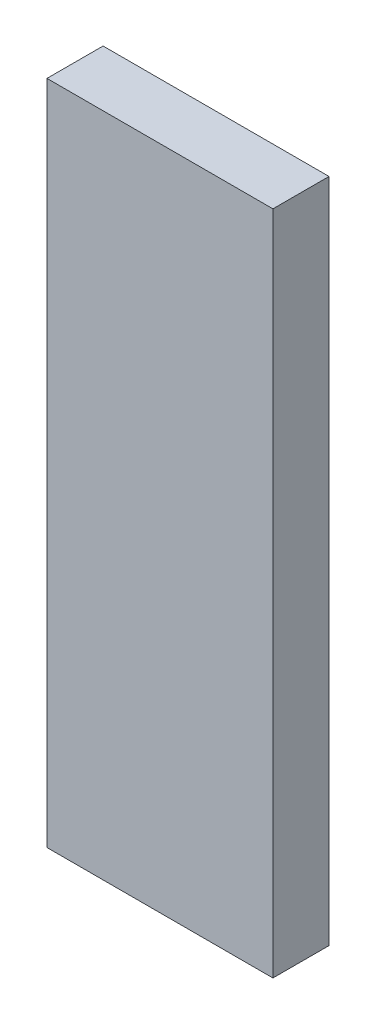
ISO-10303-21;
HEADER;
FILE_DESCRIPTION(('STEP AP214'),'2;1');
FILE_NAME('part.step','',(''),(''),'','','');
FILE_SCHEMA(('AUTOMOTIVE_DESIGN { 1 0 10303 214 1 1 1 1 }'));
ENDSEC;
DATA;
#1=APPLICATION_CONTEXT('core data for automotive mechanical design processes');
#2=APPLICATION_PROTOCOL_DEFINITION('international standard','automotive_design',2000,#1);
#3=PRODUCT_CONTEXT('',#1,'mechanical');
#4=PRODUCT('Part','Part','',(#3));
#5=PRODUCT_RELATED_PRODUCT_CATEGORY('part','',(#4));
#6=PRODUCT_DEFINITION_FORMATION('','',#4);
#7=PRODUCT_DEFINITION_CONTEXT('part definition',#1,'design');
#8=PRODUCT_DEFINITION('design','',#6,#7);
#9=PRODUCT_DEFINITION_SHAPE('','',#8);
#10=(LENGTH_UNIT() NAMED_UNIT(*) SI_UNIT(.MILLI.,.METRE.));
#11=(NAMED_UNIT(*) PLANE_ANGLE_UNIT() SI_UNIT($,.RADIAN.));
#12=(NAMED_UNIT(*) SI_UNIT($,.STERADIAN.) SOLID_ANGLE_UNIT());
#13=UNCERTAINTY_MEASURE_WITH_UNIT(LENGTH_MEASURE(1.E-05),#10,'distance_accuracy_value','');
#14=(GEOMETRIC_REPRESENTATION_CONTEXT(3) GLOBAL_UNCERTAINTY_ASSIGNED_CONTEXT((#13)) GLOBAL_UNIT_ASSIGNED_CONTEXT((#10,
#11,#12)) REPRESENTATION_CONTEXT('',''));
#15=CARTESIAN_POINT('',(0.,0.,0.));
#16=DIRECTION('',(0.,0.,1.));
#17=DIRECTION('',(1.,0.,0.));
#18=AXIS2_PLACEMENT_3D('',#15,#16,#17);
#19=CARTESIAN_POINT('',(-14.5,85.5,-3.6));
#20=DIRECTION('',(1.,0.,0.));
#21=DIRECTION('',(0.,0.,-1.));
#22=AXIS2_PLACEMENT_3D('',#19,#20,#21);
#23=PLANE('',#22);
#24=DIRECTION('',(0.,0.,1.));
#25=VECTOR('',#24,1.);
#26=CARTESIAN_POINT('',(-14.5,0.,-3.6));
#27=LINE('',#26,#25);
#28=CARTESIAN_POINT('',(-14.5,0.,-3.6));
#29=VERTEX_POINT('',#28);
#30=CARTESIAN_POINT('',(-14.5,0.,3.6));
#31=VERTEX_POINT('',#30);
#32=EDGE_CURVE('E111',#29,#31,#27,.T.);
#33=ORIENTED_EDGE('',*,*,#32,.T.);
#34=DIRECTION('',(0.,-1.,0.));
#35=VECTOR('',#34,1.);
#36=CARTESIAN_POINT('',(-14.5,85.5,3.6));
#37=LINE('',#36,#35);
#38=CARTESIAN_POINT('',(-14.5,85.5,3.6));
#39=VERTEX_POINT('',#38);
#40=EDGE_CURVE('E11',#39,#31,#37,.T.);
#41=ORIENTED_EDGE('',*,*,#40,.F.);
#42=DIRECTION('',(0.,0.,1.));
#43=VECTOR('',#42,1.);
#44=CARTESIAN_POINT('',(-14.5,85.5,-3.6));
#45=LINE('',#44,#43);
#46=CARTESIAN_POINT('',(-14.5,85.5,-3.6));
#47=VERTEX_POINT('',#46);
#48=EDGE_CURVE('E95',#47,#39,#45,.T.);
#49=ORIENTED_EDGE('',*,*,#48,.F.);
#50=DIRECTION('',(0.,-1.,0.));
#51=VECTOR('',#50,1.);
#52=CARTESIAN_POINT('',(-14.5,85.5,-3.6));
#53=LINE('',#52,#51);
#54=EDGE_CURVE('E107',#47,#29,#53,.T.);
#55=ORIENTED_EDGE('',*,*,#54,.T.);
#56=EDGE_LOOP('',(#33,#41,#49,#55));
#57=FACE_BOUND('',#56,.T.);
#58=ADVANCED_FACE('F43',(#57),#23,.F.);
#59=CARTESIAN_POINT('',(-14.5,85.5,3.6));
#60=DIRECTION('',(0.,0.,-1.));
#61=DIRECTION('',(-1.,0.,0.));
#62=AXIS2_PLACEMENT_3D('',#59,#60,#61);
#63=PLANE('',#62);
#64=DIRECTION('',(1.,0.,0.));
#65=VECTOR('',#64,1.);
#66=CARTESIAN_POINT('',(-14.5,0.,3.6));
#67=LINE('',#66,#65);
#68=CARTESIAN_POINT('',(14.5,0.,3.6));
#69=VERTEX_POINT('',#68);
#70=EDGE_CURVE('E100',#31,#69,#67,.T.);
#71=ORIENTED_EDGE('',*,*,#70,.T.);
#72=DIRECTION('',(0.,-1.,0.));
#73=VECTOR('',#72,1.);
#74=CARTESIAN_POINT('',(14.5,85.5,3.6));
#75=LINE('',#74,#73);
#76=CARTESIAN_POINT('',(14.5,85.5,3.6));
#77=VERTEX_POINT('',#76);
#78=EDGE_CURVE('E52',#77,#69,#75,.T.);
#79=ORIENTED_EDGE('',*,*,#78,.F.);
#80=DIRECTION('',(1.,0.,0.));
#81=VECTOR('',#80,1.);
#82=CARTESIAN_POINT('',(-14.5,85.5,3.6));
#83=LINE('',#82,#81);
#84=EDGE_CURVE('E90',#39,#77,#83,.T.);
#85=ORIENTED_EDGE('',*,*,#84,.F.);
#86=ORIENTED_EDGE('',*,*,#40,.T.);
#87=EDGE_LOOP('',(#71,#79,#85,#86));
#88=FACE_BOUND('',#87,.T.);
#89=ADVANCED_FACE('F99',(#88),#63,.F.);
#90=CARTESIAN_POINT('',(14.5,85.5,-3.6));
#91=DIRECTION('',(-1.,0.,0.));
#92=DIRECTION('',(0.,0.,1.));
#93=AXIS2_PLACEMENT_3D('',#90,#91,#92);
#94=PLANE('',#93);
#95=DIRECTION('',(0.,0.,-1.));
#96=VECTOR('',#95,1.);
#97=CARTESIAN_POINT('',(14.5,0.,-3.6));
#98=LINE('',#97,#96);
#99=CARTESIAN_POINT('',(14.5,0.,-3.6));
#100=VERTEX_POINT('',#99);
#101=EDGE_CURVE('E77',#69,#100,#98,.T.);
#102=ORIENTED_EDGE('',*,*,#101,.T.);
#103=DIRECTION('',(0.,-1.,0.));
#104=VECTOR('',#103,1.);
#105=CARTESIAN_POINT('',(14.5,85.5,-3.6));
#106=LINE('',#105,#104);
#107=CARTESIAN_POINT('',(14.5,85.5,-3.6));
#108=VERTEX_POINT('',#107);
#109=EDGE_CURVE('E102',#108,#100,#106,.T.);
#110=ORIENTED_EDGE('',*,*,#109,.F.);
#111=DIRECTION('',(0.,0.,-1.));
#112=VECTOR('',#111,1.);
#113=CARTESIAN_POINT('',(14.5,85.5,-3.6));
#114=LINE('',#113,#112);
#115=EDGE_CURVE('E93',#77,#108,#114,.T.);
#116=ORIENTED_EDGE('',*,*,#115,.F.);
#117=ORIENTED_EDGE('',*,*,#78,.T.);
#118=EDGE_LOOP('',(#102,#110,#116,#117));
#119=FACE_BOUND('',#118,.T.);
#120=ADVANCED_FACE('F103',(#119),#94,.F.);
#121=CARTESIAN_POINT('',(-14.5,85.5,-3.6));
#122=DIRECTION('',(0.,0.,1.));
#123=DIRECTION('',(1.,0.,0.));
#124=AXIS2_PLACEMENT_3D('',#121,#122,#123);
#125=PLANE('',#124);
#126=DIRECTION('',(-1.,0.,0.));
#127=VECTOR('',#126,1.);
#128=CARTESIAN_POINT('',(-14.5,0.,-3.6));
#129=LINE('',#128,#127);
#130=EDGE_CURVE('E83',#100,#29,#129,.T.);
#131=ORIENTED_EDGE('',*,*,#130,.T.);
#132=ORIENTED_EDGE('',*,*,#54,.F.);
#133=DIRECTION('',(-1.,0.,0.));
#134=VECTOR('',#133,1.);
#135=CARTESIAN_POINT('',(-14.5,85.5,-3.6));
#136=LINE('',#135,#134);
#137=EDGE_CURVE('E60',#108,#47,#136,.T.);
#138=ORIENTED_EDGE('',*,*,#137,.F.);
#139=ORIENTED_EDGE('',*,*,#109,.T.);
#140=EDGE_LOOP('',(#131,#132,#138,#139));
#141=FACE_BOUND('',#140,.T.);
#142=ADVANCED_FACE('F124',(#141),#125,.F.);
#143=CARTESIAN_POINT('',(0.,85.5,0.));
#144=DIRECTION('',(0.,1.,0.));
#145=DIRECTION('',(0.,0.,1.));
#146=AXIS2_PLACEMENT_3D('',#143,#144,#145);
#147=PLANE('',#146);
#148=ORIENTED_EDGE('',*,*,#48,.T.);
#149=ORIENTED_EDGE('',*,*,#84,.T.);
#150=ORIENTED_EDGE('',*,*,#115,.T.);
#151=ORIENTED_EDGE('',*,*,#137,.T.);
#152=EDGE_LOOP('',(#148,#149,#150,#151));
#153=FACE_BOUND('',#152,.T.);
#154=ADVANCED_FACE('F91',(#153),#147,.T.);
#155=CARTESIAN_POINT('',(0.,0.,0.));
#156=DIRECTION('',(0.,1.,0.));
#157=DIRECTION('',(0.,0.,1.));
#158=AXIS2_PLACEMENT_3D('',#155,#156,#157);
#159=PLANE('',#158);
#160=ORIENTED_EDGE('',*,*,#32,.F.);
#161=ORIENTED_EDGE('',*,*,#130,.F.);
#162=ORIENTED_EDGE('',*,*,#101,.F.);
#163=ORIENTED_EDGE('',*,*,#70,.F.);
#164=EDGE_LOOP('',(#160,#161,#162,#163));
#165=FACE_BOUND('',#164,.T.);
#166=ADVANCED_FACE('F127',(#165),#159,.F.);
#167=CLOSED_SHELL('',(#58,#89,#120,#142,#154,#166));
#168=MANIFOLD_SOLID_BREP('B2',#167);
#169=ADVANCED_BREP_SHAPE_REPRESENTATION('',(#18,#168),#14);
#170=SHAPE_DEFINITION_REPRESENTATION(#9,#169);
ENDSEC;
END-ISO-10303-21;
